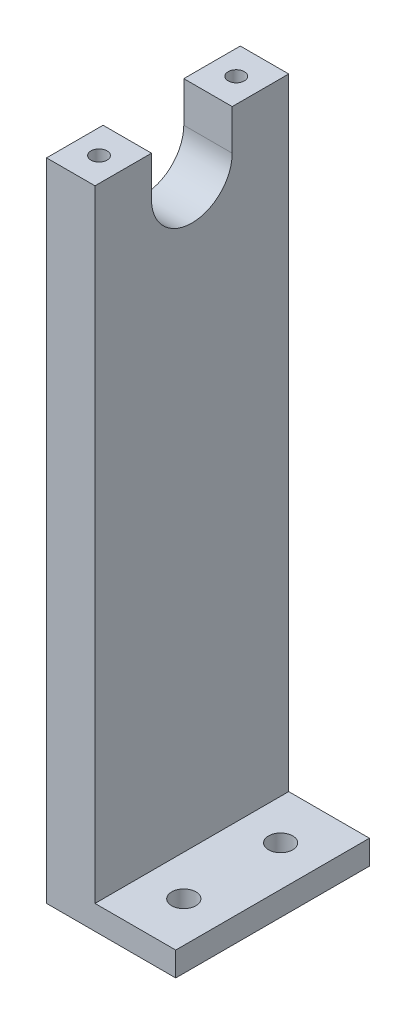
ISO-10303-21;
HEADER;
FILE_DESCRIPTION(('STEP AP214'),'2;1');
FILE_NAME('part.step','',(''),(''),'','','');
FILE_SCHEMA(('AUTOMOTIVE_DESIGN { 1 0 10303 214 1 1 1 1 }'));
ENDSEC;
DATA;
#1=APPLICATION_CONTEXT('core data for automotive mechanical design processes');
#2=APPLICATION_PROTOCOL_DEFINITION('international standard','automotive_design',2000,#1);
#3=PRODUCT_CONTEXT('',#1,'mechanical');
#4=PRODUCT('Part','Part','',(#3));
#5=PRODUCT_RELATED_PRODUCT_CATEGORY('part','',(#4));
#6=PRODUCT_DEFINITION_FORMATION('','',#4);
#7=PRODUCT_DEFINITION_CONTEXT('part definition',#1,'design');
#8=PRODUCT_DEFINITION('design','',#6,#7);
#9=PRODUCT_DEFINITION_SHAPE('','',#8);
#10=(LENGTH_UNIT() NAMED_UNIT(*) SI_UNIT(.MILLI.,.METRE.));
#11=(NAMED_UNIT(*) PLANE_ANGLE_UNIT() SI_UNIT($,.RADIAN.));
#12=(NAMED_UNIT(*) SI_UNIT($,.STERADIAN.) SOLID_ANGLE_UNIT());
#13=UNCERTAINTY_MEASURE_WITH_UNIT(LENGTH_MEASURE(1.E-05),#10,'distance_accuracy_value','');
#14=(GEOMETRIC_REPRESENTATION_CONTEXT(3) GLOBAL_UNCERTAINTY_ASSIGNED_CONTEXT((#13)) GLOBAL_UNIT_ASSIGNED_CONTEXT((#10,
#11,#12)) REPRESENTATION_CONTEXT('',''));
#15=CARTESIAN_POINT('',(0.,0.,0.));
#16=DIRECTION('',(0.,0.,1.));
#17=DIRECTION('',(1.,0.,0.));
#18=AXIS2_PLACEMENT_3D('',#15,#16,#17);
#19=CARTESIAN_POINT('',(1.5,40.,6.));
#20=DIRECTION('',(-1.,0.,0.));
#21=DIRECTION('',(0.,0.,1.));
#22=AXIS2_PLACEMENT_3D('',#19,#20,#21);
#23=PLANE('',#22);
#24=DIRECTION('',(0.,0.,1.));
#25=VECTOR('',#24,1.);
#26=CARTESIAN_POINT('',(1.5,1.5,6.));
#27=LINE('',#26,#25);
#28=CARTESIAN_POINT('',(1.5,1.5,-6.));
#29=VERTEX_POINT('',#28);
#30=CARTESIAN_POINT('',(1.5,1.5,6.));
#31=VERTEX_POINT('',#30);
#32=EDGE_CURVE('E57',#29,#31,#27,.T.);
#33=ORIENTED_EDGE('',*,*,#32,.F.);
#34=DIRECTION('',(0.,-1.,0.));
#35=VECTOR('',#34,1.);
#36=CARTESIAN_POINT('',(1.5,40.,-6.));
#37=LINE('',#36,#35);
#38=CARTESIAN_POINT('',(1.5,40.,-6.));
#39=VERTEX_POINT('',#38);
#40=EDGE_CURVE('E11',#39,#29,#37,.T.);
#41=ORIENTED_EDGE('',*,*,#40,.F.);
#42=DIRECTION('',(0.,0.,-1.));
#43=VECTOR('',#42,1.);
#44=CARTESIAN_POINT('',(1.5,40.,6.));
#45=LINE('',#44,#43);
#46=CARTESIAN_POINT('',(1.5,40.,-2.5));
#47=VERTEX_POINT('',#46);
#48=EDGE_CURVE('E131',#47,#39,#45,.T.);
#49=ORIENTED_EDGE('',*,*,#48,.F.);
#50=DIRECTION('',(0.,1.,0.));
#51=VECTOR('',#50,1.);
#52=CARTESIAN_POINT('',(1.5,40.,-2.5));
#53=LINE('',#52,#51);
#54=CARTESIAN_POINT('',(1.5,37.5,-2.5));
#55=VERTEX_POINT('',#54);
#56=EDGE_CURVE('E174',#55,#47,#53,.T.);
#57=ORIENTED_EDGE('',*,*,#56,.F.);
#58=CARTESIAN_POINT('',(1.5,37.5,0.));
#59=DIRECTION('',(1.,0.,0.));
#60=DIRECTION('',(0.,0.,1.));
#61=AXIS2_PLACEMENT_3D('',#58,#59,#60);
#62=CIRCLE('',#61,2.5);
#63=CARTESIAN_POINT('',(1.5,37.5,2.5));
#64=VERTEX_POINT('',#63);
#65=EDGE_CURVE('E183',#64,#55,#62,.T.);
#66=ORIENTED_EDGE('',*,*,#65,.F.);
#67=DIRECTION('',(0.,-1.,0.));
#68=VECTOR('',#67,1.);
#69=CARTESIAN_POINT('',(1.5,40.,2.5));
#70=LINE('',#69,#68);
#71=CARTESIAN_POINT('',(1.5,40.,2.5));
#72=VERTEX_POINT('',#71);
#73=EDGE_CURVE('E163',#72,#64,#70,.T.);
#74=ORIENTED_EDGE('',*,*,#73,.F.);
#75=CARTESIAN_POINT('',(1.5,40.,6.));
#76=VERTEX_POINT('',#75);
#77=EDGE_CURVE('E195',#76,#72,#45,.T.);
#78=ORIENTED_EDGE('',*,*,#77,.F.);
#79=DIRECTION('',(0.,-1.,0.));
#80=VECTOR('',#79,1.);
#81=CARTESIAN_POINT('',(1.5,40.,6.));
#82=LINE('',#81,#80);
#83=EDGE_CURVE('E206',#76,#31,#82,.T.);
#84=ORIENTED_EDGE('',*,*,#83,.T.);
#85=EDGE_LOOP('',(#33,#41,#49,#57,#66,#74,#78,#84));
#86=FACE_BOUND('',#85,.T.);
#87=ADVANCED_FACE('F43',(#86),#23,.F.);
#88=CARTESIAN_POINT('',(0.,40.,0.));
#89=DIRECTION('',(0.,-1.,0.));
#90=DIRECTION('',(0.,0.,-1.));
#91=AXIS2_PLACEMENT_3D('',#88,#89,#90);
#92=PLANE('',#91);
#93=CARTESIAN_POINT('',(0.,40.,-4.25));
#94=DIRECTION('',(0.,1.,0.));
#95=DIRECTION('',(0.,0.,1.));
#96=AXIS2_PLACEMENT_3D('',#93,#94,#95);
#97=CIRCLE('',#96,0.5);
#98=CARTESIAN_POINT('',(0.,40.,-3.75));
#99=VERTEX_POINT('',#98);
#100=EDGE_CURVE('E167',#99,#99,#97,.T.);
#101=ORIENTED_EDGE('',*,*,#100,.F.);
#102=EDGE_LOOP('',(#101));
#103=FACE_BOUND('',#102,.T.);
#104=DIRECTION('',(0.,0.,1.));
#105=VECTOR('',#104,1.);
#106=CARTESIAN_POINT('',(-1.5,40.,6.));
#107=LINE('',#106,#105);
#108=CARTESIAN_POINT('',(-1.5,40.,-6.));
#109=VERTEX_POINT('',#108);
#110=CARTESIAN_POINT('',(-1.5,40.,-2.5));
#111=VERTEX_POINT('',#110);
#112=EDGE_CURVE('E201',#109,#111,#107,.T.);
#113=ORIENTED_EDGE('',*,*,#112,.T.);
#114=DIRECTION('',(1.,0.,0.));
#115=VECTOR('',#114,1.);
#116=CARTESIAN_POINT('',(-1.5,40.,-2.5));
#117=LINE('',#116,#115);
#118=EDGE_CURVE('E187',#111,#47,#117,.T.);
#119=ORIENTED_EDGE('',*,*,#118,.T.);
#120=ORIENTED_EDGE('',*,*,#48,.T.);
#121=DIRECTION('',(-1.,0.,0.));
#122=VECTOR('',#121,1.);
#123=CARTESIAN_POINT('',(-1.5,40.,-6.));
#124=LINE('',#123,#122);
#125=EDGE_CURVE('E198',#39,#109,#124,.T.);
#126=ORIENTED_EDGE('',*,*,#125,.T.);
#127=EDGE_LOOP('',(#113,#119,#120,#126));
#128=FACE_BOUND('',#127,.T.);
#129=ADVANCED_FACE('F237',(#103,#128),#92,.F.);
#130=CARTESIAN_POINT('',(-1.5,40.,-6.));
#131=DIRECTION('',(0.,0.,1.));
#132=DIRECTION('',(1.,0.,0.));
#133=AXIS2_PLACEMENT_3D('',#130,#131,#132);
#134=PLANE('',#133);
#135=DIRECTION('',(-1.,0.,0.));
#136=VECTOR('',#135,1.);
#137=CARTESIAN_POINT('',(-1.5,0.,-6.));
#138=LINE('',#137,#136);
#139=CARTESIAN_POINT('',(6.5,0.,-6.));
#140=VERTEX_POINT('',#139);
#141=CARTESIAN_POINT('',(-1.5,0.,-6.));
#142=VERTEX_POINT('',#141);
#143=EDGE_CURVE('E137',#140,#142,#138,.T.);
#144=ORIENTED_EDGE('',*,*,#143,.T.);
#145=DIRECTION('',(0.,-1.,0.));
#146=VECTOR('',#145,1.);
#147=CARTESIAN_POINT('',(-1.5,40.,-6.));
#148=LINE('',#147,#146);
#149=EDGE_CURVE('E50',#109,#142,#148,.T.);
#150=ORIENTED_EDGE('',*,*,#149,.F.);
#151=ORIENTED_EDGE('',*,*,#125,.F.);
#152=ORIENTED_EDGE('',*,*,#40,.T.);
#153=DIRECTION('',(-1.,0.,0.));
#154=VECTOR('',#153,1.);
#155=CARTESIAN_POINT('',(6.5,1.5,-6.));
#156=LINE('',#155,#154);
#157=CARTESIAN_POINT('',(6.5,1.5,-6.));
#158=VERTEX_POINT('',#157);
#159=EDGE_CURVE('E156',#158,#29,#156,.T.);
#160=ORIENTED_EDGE('',*,*,#159,.F.);
#161=DIRECTION('',(0.,1.,0.));
#162=VECTOR('',#161,1.);
#163=CARTESIAN_POINT('',(6.5,0.,-6.));
#164=LINE('',#163,#162);
#165=EDGE_CURVE('E140',#140,#158,#164,.T.);
#166=ORIENTED_EDGE('',*,*,#165,.F.);
#167=EDGE_LOOP('',(#144,#150,#151,#152,#160,#166));
#168=FACE_BOUND('',#167,.T.);
#169=ADVANCED_FACE('F217',(#168),#134,.F.);
#170=CARTESIAN_POINT('',(-1.5,40.,6.));
#171=DIRECTION('',(1.,0.,0.));
#172=DIRECTION('',(0.,0.,-1.));
#173=AXIS2_PLACEMENT_3D('',#170,#171,#172);
#174=PLANE('',#173);
#175=CARTESIAN_POINT('',(-1.5,37.5,0.));
#176=DIRECTION('',(1.,0.,0.));
#177=DIRECTION('',(0.,0.,1.));
#178=AXIS2_PLACEMENT_3D('',#175,#176,#177);
#179=CIRCLE('',#178,2.5);
#180=CARTESIAN_POINT('',(-1.5,37.5,2.5));
#181=VERTEX_POINT('',#180);
#182=CARTESIAN_POINT('',(-1.5,37.5,-2.5));
#183=VERTEX_POINT('',#182);
#184=EDGE_CURVE('E173',#181,#183,#179,.T.);
#185=ORIENTED_EDGE('',*,*,#184,.T.);
#186=DIRECTION('',(0.,1.,0.));
#187=VECTOR('',#186,1.);
#188=CARTESIAN_POINT('',(-1.5,40.,-2.5));
#189=LINE('',#188,#187);
#190=EDGE_CURVE('E177',#183,#111,#189,.T.);
#191=ORIENTED_EDGE('',*,*,#190,.T.);
#192=ORIENTED_EDGE('',*,*,#112,.F.);
#193=ORIENTED_EDGE('',*,*,#149,.T.);
#194=DIRECTION('',(0.,0.,1.));
#195=VECTOR('',#194,1.);
#196=CARTESIAN_POINT('',(-1.5,0.,6.));
#197=LINE('',#196,#195);
#198=CARTESIAN_POINT('',(-1.5,0.,6.));
#199=VERTEX_POINT('',#198);
#200=EDGE_CURVE('E132',#142,#199,#197,.T.);
#201=ORIENTED_EDGE('',*,*,#200,.T.);
#202=DIRECTION('',(0.,-1.,0.));
#203=VECTOR('',#202,1.);
#204=CARTESIAN_POINT('',(-1.5,40.,6.));
#205=LINE('',#204,#203);
#206=CARTESIAN_POINT('',(-1.5,40.,6.));
#207=VERTEX_POINT('',#206);
#208=EDGE_CURVE('E128',#207,#199,#205,.T.);
#209=ORIENTED_EDGE('',*,*,#208,.F.);
#210=CARTESIAN_POINT('',(-1.5,40.,2.5));
#211=VERTEX_POINT('',#210);
#212=EDGE_CURVE('E200',#211,#207,#107,.T.);
#213=ORIENTED_EDGE('',*,*,#212,.F.);
#214=DIRECTION('',(0.,-1.,0.));
#215=VECTOR('',#214,1.);
#216=CARTESIAN_POINT('',(-1.5,40.,2.5));
#217=LINE('',#216,#215);
#218=EDGE_CURVE('E64',#211,#181,#217,.T.);
#219=ORIENTED_EDGE('',*,*,#218,.T.);
#220=EDGE_LOOP('',(#185,#191,#192,#193,#201,#209,#213,#219));
#221=FACE_BOUND('',#220,.T.);
#222=ADVANCED_FACE('F214',(#221),#174,.F.);
#223=CARTESIAN_POINT('',(-1.5,40.,6.));
#224=DIRECTION('',(0.,0.,-1.));
#225=DIRECTION('',(-1.,0.,0.));
#226=AXIS2_PLACEMENT_3D('',#223,#224,#225);
#227=PLANE('',#226);
#228=DIRECTION('',(1.,0.,0.));
#229=VECTOR('',#228,1.);
#230=CARTESIAN_POINT('',(-1.5,0.,6.));
#231=LINE('',#230,#229);
#232=CARTESIAN_POINT('',(6.5,0.,6.));
#233=VERTEX_POINT('',#232);
#234=EDGE_CURVE('E120',#199,#233,#231,.T.);
#235=ORIENTED_EDGE('',*,*,#234,.T.);
#236=DIRECTION('',(0.,-1.,0.));
#237=VECTOR('',#236,1.);
#238=CARTESIAN_POINT('',(6.5,0.,6.));
#239=LINE('',#238,#237);
#240=CARTESIAN_POINT('',(6.5,1.5,6.));
#241=VERTEX_POINT('',#240);
#242=EDGE_CURVE('E125',#241,#233,#239,.T.);
#243=ORIENTED_EDGE('',*,*,#242,.F.);
#244=DIRECTION('',(-1.,0.,0.));
#245=VECTOR('',#244,1.);
#246=CARTESIAN_POINT('',(6.5,1.5,6.));
#247=LINE('',#246,#245);
#248=EDGE_CURVE('E153',#241,#31,#247,.T.);
#249=ORIENTED_EDGE('',*,*,#248,.T.);
#250=ORIENTED_EDGE('',*,*,#83,.F.);
#251=DIRECTION('',(1.,0.,0.));
#252=VECTOR('',#251,1.);
#253=CARTESIAN_POINT('',(-1.5,40.,6.));
#254=LINE('',#253,#252);
#255=EDGE_CURVE('E204',#207,#76,#254,.T.);
#256=ORIENTED_EDGE('',*,*,#255,.F.);
#257=ORIENTED_EDGE('',*,*,#208,.T.);
#258=EDGE_LOOP('',(#235,#243,#249,#250,#256,#257));
#259=FACE_BOUND('',#258,.T.);
#260=ADVANCED_FACE('F122',(#259),#227,.F.);
#261=CARTESIAN_POINT('',(0.,40.,4.25));
#262=DIRECTION('',(0.,1.,0.));
#263=DIRECTION('',(0.,0.,1.));
#264=AXIS2_PLACEMENT_3D('',#261,#262,#263);
#265=CIRCLE('',#264,0.5);
#266=CARTESIAN_POINT('',(0.,40.,4.75));
#267=VERTEX_POINT('',#266);
#268=EDGE_CURVE('E164',#267,#267,#265,.T.);
#269=ORIENTED_EDGE('',*,*,#268,.F.);
#270=EDGE_LOOP('',(#269));
#271=FACE_BOUND('',#270,.T.);
#272=ORIENTED_EDGE('',*,*,#77,.T.);
#273=DIRECTION('',(1.,0.,0.));
#274=VECTOR('',#273,1.);
#275=CARTESIAN_POINT('',(-1.5,40.,2.5));
#276=LINE('',#275,#274);
#277=EDGE_CURVE('E180',#211,#72,#276,.T.);
#278=ORIENTED_EDGE('',*,*,#277,.F.);
#279=ORIENTED_EDGE('',*,*,#212,.T.);
#280=ORIENTED_EDGE('',*,*,#255,.T.);
#281=EDGE_LOOP('',(#272,#278,#279,#280));
#282=FACE_BOUND('',#281,.T.);
#283=ADVANCED_FACE('F226',(#271,#282),#92,.F.);
#284=CARTESIAN_POINT('',(0.,0.,0.));
#285=DIRECTION('',(0.,-1.,0.));
#286=DIRECTION('',(0.,0.,-1.));
#287=AXIS2_PLACEMENT_3D('',#284,#285,#286);
#288=PLANE('',#287);
#289=CARTESIAN_POINT('',(4.,0.,-3.));
#290=DIRECTION('',(0.,-1.,0.));
#291=DIRECTION('',(0.,0.,-1.));
#292=AXIS2_PLACEMENT_3D('',#289,#290,#291);
#293=CIRCLE('',#292,0.75);
#294=CARTESIAN_POINT('',(4.,0.,-3.75));
#295=VERTEX_POINT('',#294);
#296=EDGE_CURVE('E147',#295,#295,#293,.T.);
#297=ORIENTED_EDGE('',*,*,#296,.F.);
#298=EDGE_LOOP('',(#297));
#299=FACE_BOUND('',#298,.T.);
#300=CARTESIAN_POINT('',(4.,0.,3.));
#301=DIRECTION('',(0.,-1.,0.));
#302=DIRECTION('',(0.,0.,-1.));
#303=AXIS2_PLACEMENT_3D('',#300,#301,#302);
#304=CIRCLE('',#303,0.75);
#305=CARTESIAN_POINT('',(4.,0.,2.25));
#306=VERTEX_POINT('',#305);
#307=EDGE_CURVE('E412',#306,#306,#304,.T.);
#308=ORIENTED_EDGE('',*,*,#307,.F.);
#309=EDGE_LOOP('',(#308));
#310=FACE_BOUND('',#309,.T.);
#311=ORIENTED_EDGE('',*,*,#143,.F.);
#312=DIRECTION('',(0.,0.,-1.));
#313=VECTOR('',#312,1.);
#314=CARTESIAN_POINT('',(6.5,0.,6.));
#315=LINE('',#314,#313);
#316=EDGE_CURVE('E135',#233,#140,#315,.T.);
#317=ORIENTED_EDGE('',*,*,#316,.F.);
#318=ORIENTED_EDGE('',*,*,#234,.F.);
#319=ORIENTED_EDGE('',*,*,#200,.F.);
#320=EDGE_LOOP('',(#311,#317,#318,#319));
#321=FACE_BOUND('',#320,.T.);
#322=ADVANCED_FACE('F136',(#299,#310,#321),#288,.T.);
#323=CARTESIAN_POINT('',(-1.5,40.,-2.5));
#324=DIRECTION('',(0.,0.,-1.));
#325=DIRECTION('',(-1.,0.,0.));
#326=AXIS2_PLACEMENT_3D('',#323,#324,#325);
#327=PLANE('',#326);
#328=ORIENTED_EDGE('',*,*,#56,.T.);
#329=ORIENTED_EDGE('',*,*,#118,.F.);
#330=ORIENTED_EDGE('',*,*,#190,.F.);
#331=DIRECTION('',(1.,0.,0.));
#332=VECTOR('',#331,1.);
#333=CARTESIAN_POINT('',(-1.5,37.5,-2.5));
#334=LINE('',#333,#332);
#335=EDGE_CURVE('E190',#183,#55,#334,.T.);
#336=ORIENTED_EDGE('',*,*,#335,.T.);
#337=EDGE_LOOP('',(#328,#329,#330,#336));
#338=FACE_BOUND('',#337,.T.);
#339=ADVANCED_FACE('F234',(#338),#327,.F.);
#340=CARTESIAN_POINT('',(-1.5,37.5,0.));
#341=DIRECTION('',(1.,0.,0.));
#342=DIRECTION('',(0.,0.,-1.));
#343=AXIS2_PLACEMENT_3D('',#340,#341,#342);
#344=CYLINDRICAL_SURFACE('',#343,2.5);
#345=ORIENTED_EDGE('',*,*,#65,.T.);
#346=ORIENTED_EDGE('',*,*,#335,.F.);
#347=ORIENTED_EDGE('',*,*,#184,.F.);
#348=DIRECTION('',(1.,0.,0.));
#349=VECTOR('',#348,1.);
#350=CARTESIAN_POINT('',(-1.5,37.5,2.5));
#351=LINE('',#350,#349);
#352=EDGE_CURVE('E192',#181,#64,#351,.T.);
#353=ORIENTED_EDGE('',*,*,#352,.T.);
#354=EDGE_LOOP('',(#345,#346,#347,#353));
#355=FACE_BOUND('',#354,.T.);
#356=ADVANCED_FACE('F231',(#355),#344,.F.);
#357=CARTESIAN_POINT('',(-1.5,40.,2.5));
#358=DIRECTION('',(0.,0.,1.));
#359=DIRECTION('',(0.,-1.,0.));
#360=AXIS2_PLACEMENT_3D('',#357,#358,#359);
#361=PLANE('',#360);
#362=ORIENTED_EDGE('',*,*,#73,.T.);
#363=ORIENTED_EDGE('',*,*,#352,.F.);
#364=ORIENTED_EDGE('',*,*,#218,.F.);
#365=ORIENTED_EDGE('',*,*,#277,.T.);
#366=EDGE_LOOP('',(#362,#363,#364,#365));
#367=FACE_BOUND('',#366,.T.);
#368=ADVANCED_FACE('F261',(#367),#361,.F.);
#369=CARTESIAN_POINT('',(0.,35.,4.25));
#370=DIRECTION('',(0.,1.,0.));
#371=DIRECTION('',(0.,0.,1.));
#372=AXIS2_PLACEMENT_3D('',#369,#370,#371);
#373=CYLINDRICAL_SURFACE('',#372,0.5);
#374=CARTESIAN_POINT('',(0.,35.,4.25));
#375=DIRECTION('',(0.,1.,0.));
#376=DIRECTION('',(0.,0.,1.));
#377=AXIS2_PLACEMENT_3D('',#374,#375,#376);
#378=CIRCLE('',#377,0.5);
#379=CARTESIAN_POINT('',(0.,35.,4.75));
#380=VERTEX_POINT('',#379);
#381=EDGE_CURVE('E160',#380,#380,#378,.T.);
#382=ORIENTED_EDGE('',*,*,#381,.F.);
#383=EDGE_LOOP('',(#382));
#384=FACE_BOUND('',#383,.T.);
#385=ORIENTED_EDGE('',*,*,#268,.T.);
#386=EDGE_LOOP('',(#385));
#387=FACE_BOUND('',#386,.T.);
#388=ADVANCED_FACE('F258',(#384,#387),#373,.F.);
#389=CARTESIAN_POINT('',(0.,35.,4.25));
#390=DIRECTION('',(0.,1.,0.));
#391=DIRECTION('',(0.,0.,1.));
#392=AXIS2_PLACEMENT_3D('',#389,#390,#391);
#393=PLANE('',#392);
#394=ORIENTED_EDGE('',*,*,#381,.T.);
#395=EDGE_LOOP('',(#394));
#396=FACE_BOUND('',#395,.T.);
#397=ADVANCED_FACE('F260',(#396),#393,.T.);
#398=CARTESIAN_POINT('',(0.,35.,-4.25));
#399=DIRECTION('',(0.,1.,0.));
#400=DIRECTION('',(0.,0.,1.));
#401=AXIS2_PLACEMENT_3D('',#398,#399,#400);
#402=CYLINDRICAL_SURFACE('',#401,0.5);
#403=CARTESIAN_POINT('',(0.,35.,-4.25));
#404=DIRECTION('',(0.,1.,0.));
#405=DIRECTION('',(0.,0.,1.));
#406=AXIS2_PLACEMENT_3D('',#403,#404,#405);
#407=CIRCLE('',#406,0.5);
#408=CARTESIAN_POINT('',(0.,35.,-3.75));
#409=VERTEX_POINT('',#408);
#410=EDGE_CURVE('E159',#409,#409,#407,.T.);
#411=ORIENTED_EDGE('',*,*,#410,.F.);
#412=EDGE_LOOP('',(#411));
#413=FACE_BOUND('',#412,.T.);
#414=ORIENTED_EDGE('',*,*,#100,.T.);
#415=EDGE_LOOP('',(#414));
#416=FACE_BOUND('',#415,.T.);
#417=ADVANCED_FACE('F268',(#413,#416),#402,.F.);
#418=CARTESIAN_POINT('',(0.,35.,-4.25));
#419=DIRECTION('',(0.,1.,0.));
#420=DIRECTION('',(0.,0.,1.));
#421=AXIS2_PLACEMENT_3D('',#418,#419,#420);
#422=PLANE('',#421);
#423=ORIENTED_EDGE('',*,*,#410,.T.);
#424=EDGE_LOOP('',(#423));
#425=FACE_BOUND('',#424,.T.);
#426=ADVANCED_FACE('F276',(#425),#422,.T.);
#427=CARTESIAN_POINT('',(6.5,1.5,6.));
#428=DIRECTION('',(0.,-1.,0.));
#429=DIRECTION('',(0.,0.,-1.));
#430=AXIS2_PLACEMENT_3D('',#427,#428,#429);
#431=PLANE('',#430);
#432=CARTESIAN_POINT('',(4.,1.5,-3.));
#433=DIRECTION('',(0.,1.,0.));
#434=DIRECTION('',(0.,0.,1.));
#435=AXIS2_PLACEMENT_3D('',#432,#433,#434);
#436=CIRCLE('',#435,0.75);
#437=CARTESIAN_POINT('',(4.,1.5,-2.25));
#438=VERTEX_POINT('',#437);
#439=EDGE_CURVE('E411',#438,#438,#436,.T.);
#440=ORIENTED_EDGE('',*,*,#439,.F.);
#441=EDGE_LOOP('',(#440));
#442=FACE_BOUND('',#441,.T.);
#443=CARTESIAN_POINT('',(4.,1.5,3.));
#444=DIRECTION('',(0.,1.,0.));
#445=DIRECTION('',(0.,0.,1.));
#446=AXIS2_PLACEMENT_3D('',#443,#444,#445);
#447=CIRCLE('',#446,0.75);
#448=CARTESIAN_POINT('',(4.,1.5,3.75));
#449=VERTEX_POINT('',#448);
#450=EDGE_CURVE('E413',#449,#449,#447,.T.);
#451=ORIENTED_EDGE('',*,*,#450,.F.);
#452=EDGE_LOOP('',(#451));
#453=FACE_BOUND('',#452,.T.);
#454=ORIENTED_EDGE('',*,*,#32,.T.);
#455=ORIENTED_EDGE('',*,*,#248,.F.);
#456=DIRECTION('',(0.,0.,1.));
#457=VECTOR('',#456,1.);
#458=CARTESIAN_POINT('',(6.5,1.5,6.));
#459=LINE('',#458,#457);
#460=EDGE_CURVE('E144',#158,#241,#459,.T.);
#461=ORIENTED_EDGE('',*,*,#460,.F.);
#462=ORIENTED_EDGE('',*,*,#159,.T.);
#463=EDGE_LOOP('',(#454,#455,#461,#462));
#464=FACE_BOUND('',#463,.T.);
#465=ADVANCED_FACE('F220',(#442,#453,#464),#431,.F.);
#466=CARTESIAN_POINT('',(6.5,0.,0.));
#467=DIRECTION('',(-1.,0.,0.));
#468=DIRECTION('',(0.,0.,1.));
#469=AXIS2_PLACEMENT_3D('',#466,#467,#468);
#470=PLANE('',#469);
#471=ORIENTED_EDGE('',*,*,#242,.T.);
#472=ORIENTED_EDGE('',*,*,#316,.T.);
#473=ORIENTED_EDGE('',*,*,#165,.T.);
#474=ORIENTED_EDGE('',*,*,#460,.T.);
#475=EDGE_LOOP('',(#471,#472,#473,#474));
#476=FACE_BOUND('',#475,.T.);
#477=ADVANCED_FACE('F142',(#476),#470,.F.);
#478=CARTESIAN_POINT('',(4.,-3.5,3.));
#479=DIRECTION('',(0.,1.,0.));
#480=DIRECTION('',(0.,0.,1.));
#481=AXIS2_PLACEMENT_3D('',#478,#479,#480);
#482=CYLINDRICAL_SURFACE('',#481,0.75);
#483=ORIENTED_EDGE('',*,*,#307,.T.);
#484=EDGE_LOOP('',(#483));
#485=FACE_BOUND('',#484,.T.);
#486=ORIENTED_EDGE('',*,*,#450,.T.);
#487=EDGE_LOOP('',(#486));
#488=FACE_BOUND('',#487,.T.);
#489=ADVANCED_FACE('F364',(#485,#488),#482,.F.);
#490=CARTESIAN_POINT('',(4.,-3.5,-3.));
#491=DIRECTION('',(0.,1.,0.));
#492=DIRECTION('',(0.,0.,1.));
#493=AXIS2_PLACEMENT_3D('',#490,#491,#492);
#494=CYLINDRICAL_SURFACE('',#493,0.75);
#495=ORIENTED_EDGE('',*,*,#296,.T.);
#496=EDGE_LOOP('',(#495));
#497=FACE_BOUND('',#496,.T.);
#498=ORIENTED_EDGE('',*,*,#439,.T.);
#499=EDGE_LOOP('',(#498));
#500=FACE_BOUND('',#499,.T.);
#501=ADVANCED_FACE('F386',(#497,#500),#494,.F.);
#502=CLOSED_SHELL('',(#87,#129,#169,#222,#260,#283,#322,#339,#356,#368,#388,#397,#417,#426,#465,
#477,#489,#501));
#503=MANIFOLD_SOLID_BREP('B2',#502);
#504=ADVANCED_BREP_SHAPE_REPRESENTATION('',(#18,#503),#14);
#505=SHAPE_DEFINITION_REPRESENTATION(#9,#504);
ENDSEC;
END-ISO-10303-21;
